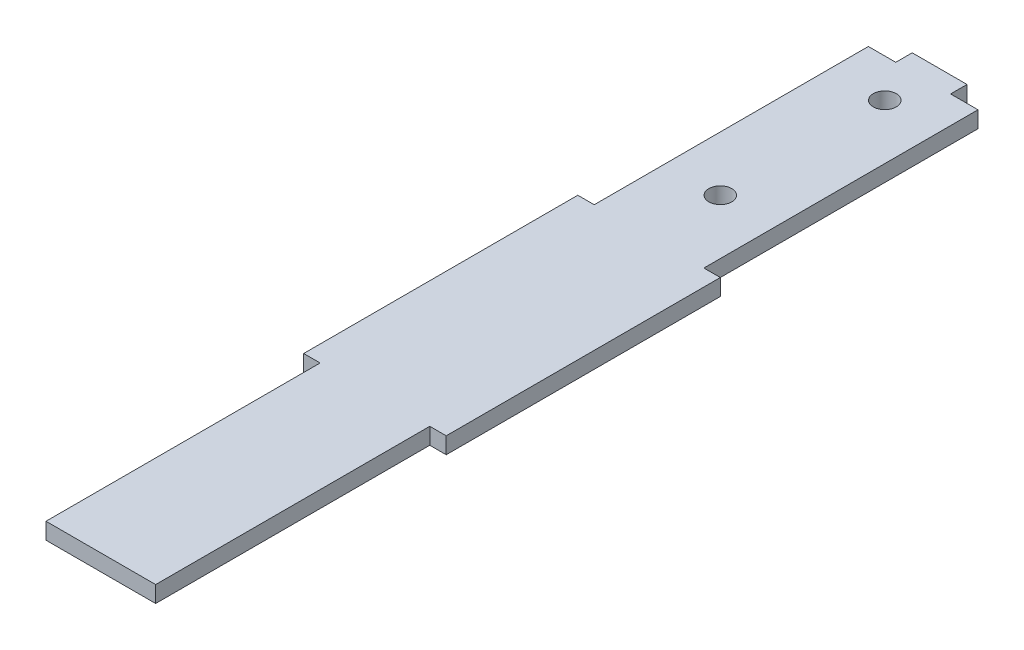
ISO-10303-21;
HEADER;
FILE_DESCRIPTION(('STEP AP214'),'2;1');
FILE_NAME('part.step','',(''),(''),'','','');
FILE_SCHEMA(('AUTOMOTIVE_DESIGN { 1 0 10303 214 1 1 1 1 }'));
ENDSEC;
DATA;
#1=APPLICATION_CONTEXT('core data for automotive mechanical design processes');
#2=APPLICATION_PROTOCOL_DEFINITION('international standard','automotive_design',2000,#1);
#3=PRODUCT_CONTEXT('',#1,'mechanical');
#4=PRODUCT('Part','Part','',(#3));
#5=PRODUCT_RELATED_PRODUCT_CATEGORY('part','',(#4));
#6=PRODUCT_DEFINITION_FORMATION('','',#4);
#7=PRODUCT_DEFINITION_CONTEXT('part definition',#1,'design');
#8=PRODUCT_DEFINITION('design','',#6,#7);
#9=PRODUCT_DEFINITION_SHAPE('','',#8);
#10=(LENGTH_UNIT() NAMED_UNIT(*) SI_UNIT(.MILLI.,.METRE.));
#11=(NAMED_UNIT(*) PLANE_ANGLE_UNIT() SI_UNIT($,.RADIAN.));
#12=(NAMED_UNIT(*) SI_UNIT($,.STERADIAN.) SOLID_ANGLE_UNIT());
#13=UNCERTAINTY_MEASURE_WITH_UNIT(LENGTH_MEASURE(1.E-05),#10,'distance_accuracy_value','');
#14=(GEOMETRIC_REPRESENTATION_CONTEXT(3) GLOBAL_UNCERTAINTY_ASSIGNED_CONTEXT((#13)) GLOBAL_UNIT_ASSIGNED_CONTEXT((#10,
#11,#12)) REPRESENTATION_CONTEXT('',''));
#15=CARTESIAN_POINT('',(0.,0.,0.));
#16=DIRECTION('',(0.,0.,1.));
#17=DIRECTION('',(1.,0.,0.));
#18=AXIS2_PLACEMENT_3D('',#15,#16,#17);
#19=CARTESIAN_POINT('',(0.,3.,0.));
#20=DIRECTION('',(1.,0.,0.));
#21=DIRECTION('',(0.,0.,-1.));
#22=AXIS2_PLACEMENT_3D('',#19,#20,#21);
#23=PLANE('',#22);
#24=DIRECTION('',(0.,0.,1.));
#25=VECTOR('',#24,1.);
#26=CARTESIAN_POINT('',(0.,0.,0.));
#27=LINE('',#26,#25);
#28=CARTESIAN_POINT('',(0.,0.,0.));
#29=VERTEX_POINT('',#28);
#30=CARTESIAN_POINT('',(0.,0.,50.));
#31=VERTEX_POINT('',#30);
#32=EDGE_CURVE('E179',#29,#31,#27,.T.);
#33=ORIENTED_EDGE('',*,*,#32,.T.);
#34=DIRECTION('',(0.,-1.,0.));
#35=VECTOR('',#34,1.);
#36=CARTESIAN_POINT('',(0.,3.,50.));
#37=LINE('',#36,#35);
#38=CARTESIAN_POINT('',(0.,3.,50.));
#39=VERTEX_POINT('',#38);
#40=EDGE_CURVE('E11',#39,#31,#37,.T.);
#41=ORIENTED_EDGE('',*,*,#40,.F.);
#42=DIRECTION('',(0.,0.,1.));
#43=VECTOR('',#42,1.);
#44=CARTESIAN_POINT('',(0.,3.,0.));
#45=LINE('',#44,#43);
#46=CARTESIAN_POINT('',(0.,3.,0.));
#47=VERTEX_POINT('',#46);
#48=EDGE_CURVE('E210',#47,#39,#45,.T.);
#49=ORIENTED_EDGE('',*,*,#48,.F.);
#50=DIRECTION('',(0.,-1.,0.));
#51=VECTOR('',#50,1.);
#52=CARTESIAN_POINT('',(0.,3.,0.));
#53=LINE('',#52,#51);
#54=EDGE_CURVE('E175',#47,#29,#53,.T.);
#55=ORIENTED_EDGE('',*,*,#54,.T.);
#56=EDGE_LOOP('',(#33,#41,#49,#55));
#57=FACE_BOUND('',#56,.T.);
#58=ADVANCED_FACE('F35',(#57),#23,.F.);
#59=CARTESIAN_POINT('',(0.,3.,50.));
#60=DIRECTION('',(0.,0.,1.));
#61=DIRECTION('',(1.,0.,0.));
#62=AXIS2_PLACEMENT_3D('',#59,#60,#61);
#63=PLANE('',#62);
#64=DIRECTION('',(-1.,0.,0.));
#65=VECTOR('',#64,1.);
#66=CARTESIAN_POINT('',(0.,0.,50.));
#67=LINE('',#66,#65);
#68=CARTESIAN_POINT('',(-3.,0.,50.));
#69=VERTEX_POINT('',#68);
#70=EDGE_CURVE('E182',#31,#69,#67,.T.);
#71=ORIENTED_EDGE('',*,*,#70,.T.);
#72=DIRECTION('',(0.,-1.,0.));
#73=VECTOR('',#72,1.);
#74=CARTESIAN_POINT('',(-3.,3.,50.));
#75=LINE('',#74,#73);
#76=CARTESIAN_POINT('',(-3.,3.,50.));
#77=VERTEX_POINT('',#76);
#78=EDGE_CURVE('E43',#77,#69,#75,.T.);
#79=ORIENTED_EDGE('',*,*,#78,.F.);
#80=DIRECTION('',(-1.,0.,0.));
#81=VECTOR('',#80,1.);
#82=CARTESIAN_POINT('',(0.,3.,50.));
#83=LINE('',#82,#81);
#84=EDGE_CURVE('E118',#39,#77,#83,.T.);
#85=ORIENTED_EDGE('',*,*,#84,.F.);
#86=ORIENTED_EDGE('',*,*,#40,.T.);
#87=EDGE_LOOP('',(#71,#79,#85,#86));
#88=FACE_BOUND('',#87,.T.);
#89=ADVANCED_FACE('F310',(#88),#63,.F.);
#90=CARTESIAN_POINT('',(-3.,3.,50.));
#91=DIRECTION('',(1.,0.,0.));
#92=DIRECTION('',(0.,0.,-1.));
#93=AXIS2_PLACEMENT_3D('',#90,#91,#92);
#94=PLANE('',#93);
#95=DIRECTION('',(0.,0.,1.));
#96=VECTOR('',#95,1.);
#97=CARTESIAN_POINT('',(-3.,0.,50.));
#98=LINE('',#97,#96);
#99=CARTESIAN_POINT('',(-2.99999999999999,0.,100.));
#100=VERTEX_POINT('',#99);
#101=EDGE_CURVE('E185',#69,#100,#98,.T.);
#102=ORIENTED_EDGE('',*,*,#101,.T.);
#103=DIRECTION('',(0.,-1.,0.));
#104=VECTOR('',#103,1.);
#105=CARTESIAN_POINT('',(-2.99999999999999,3.,100.));
#106=LINE('',#105,#104);
#107=CARTESIAN_POINT('',(-2.99999999999999,3.,100.));
#108=VERTEX_POINT('',#107);
#109=EDGE_CURVE('E241',#108,#100,#106,.T.);
#110=ORIENTED_EDGE('',*,*,#109,.F.);
#111=DIRECTION('',(0.,0.,1.));
#112=VECTOR('',#111,1.);
#113=CARTESIAN_POINT('',(-3.,3.,50.));
#114=LINE('',#113,#112);
#115=EDGE_CURVE('E249',#77,#108,#114,.T.);
#116=ORIENTED_EDGE('',*,*,#115,.F.);
#117=ORIENTED_EDGE('',*,*,#78,.T.);
#118=EDGE_LOOP('',(#102,#110,#116,#117));
#119=FACE_BOUND('',#118,.T.);
#120=ADVANCED_FACE('F247',(#119),#94,.F.);
#121=CARTESIAN_POINT('',(0.,3.,100.));
#122=DIRECTION('',(0.,0.,-1.));
#123=DIRECTION('',(-1.,0.,0.));
#124=AXIS2_PLACEMENT_3D('',#121,#122,#123);
#125=PLANE('',#124);
#126=DIRECTION('',(1.,0.,0.));
#127=VECTOR('',#126,1.);
#128=CARTESIAN_POINT('',(0.,0.,100.));
#129=LINE('',#128,#127);
#130=CARTESIAN_POINT('',(0.,0.,100.));
#131=VERTEX_POINT('',#130);
#132=EDGE_CURVE('E187',#100,#131,#129,.T.);
#133=ORIENTED_EDGE('',*,*,#132,.T.);
#134=DIRECTION('',(0.,-1.,0.));
#135=VECTOR('',#134,1.);
#136=CARTESIAN_POINT('',(0.,3.,100.));
#137=LINE('',#136,#135);
#138=CARTESIAN_POINT('',(0.,3.,100.));
#139=VERTEX_POINT('',#138);
#140=EDGE_CURVE('E238',#139,#131,#137,.T.);
#141=ORIENTED_EDGE('',*,*,#140,.F.);
#142=DIRECTION('',(1.,0.,0.));
#143=VECTOR('',#142,1.);
#144=CARTESIAN_POINT('',(0.,3.,100.));
#145=LINE('',#144,#143);
#146=EDGE_CURVE('E267',#108,#139,#145,.T.);
#147=ORIENTED_EDGE('',*,*,#146,.F.);
#148=ORIENTED_EDGE('',*,*,#109,.T.);
#149=EDGE_LOOP('',(#133,#141,#147,#148));
#150=FACE_BOUND('',#149,.T.);
#151=ADVANCED_FACE('F258',(#150),#125,.F.);
#152=CARTESIAN_POINT('',(0.,3.,100.));
#153=DIRECTION('',(1.,0.,0.));
#154=DIRECTION('',(0.,0.,-1.));
#155=AXIS2_PLACEMENT_3D('',#152,#153,#154);
#156=PLANE('',#155);
#157=DIRECTION('',(0.,0.,1.));
#158=VECTOR('',#157,1.);
#159=CARTESIAN_POINT('',(0.,0.,100.));
#160=LINE('',#159,#158);
#161=CARTESIAN_POINT('',(0.,0.,150.));
#162=VERTEX_POINT('',#161);
#163=EDGE_CURVE('E189',#131,#162,#160,.T.);
#164=ORIENTED_EDGE('',*,*,#163,.T.);
#165=DIRECTION('',(0.,-1.,0.));
#166=VECTOR('',#165,1.);
#167=CARTESIAN_POINT('',(0.,3.,150.));
#168=LINE('',#167,#166);
#169=CARTESIAN_POINT('',(0.,3.,150.));
#170=VERTEX_POINT('',#169);
#171=EDGE_CURVE('E235',#170,#162,#168,.T.);
#172=ORIENTED_EDGE('',*,*,#171,.F.);
#173=DIRECTION('',(0.,0.,1.));
#174=VECTOR('',#173,1.);
#175=CARTESIAN_POINT('',(0.,3.,100.));
#176=LINE('',#175,#174);
#177=EDGE_CURVE('E264',#139,#170,#176,.T.);
#178=ORIENTED_EDGE('',*,*,#177,.F.);
#179=ORIENTED_EDGE('',*,*,#140,.T.);
#180=EDGE_LOOP('',(#164,#172,#178,#179));
#181=FACE_BOUND('',#180,.T.);
#182=ADVANCED_FACE('F262',(#181),#156,.F.);
#183=CARTESIAN_POINT('',(0.,3.,150.));
#184=DIRECTION('',(0.,0.,-1.));
#185=DIRECTION('',(-1.,0.,0.));
#186=AXIS2_PLACEMENT_3D('',#183,#184,#185);
#187=PLANE('',#186);
#188=DIRECTION('',(1.,0.,0.));
#189=VECTOR('',#188,1.);
#190=CARTESIAN_POINT('',(0.,0.,150.));
#191=LINE('',#190,#189);
#192=CARTESIAN_POINT('',(20.,0.,150.));
#193=VERTEX_POINT('',#192);
#194=EDGE_CURVE('E191',#162,#193,#191,.T.);
#195=ORIENTED_EDGE('',*,*,#194,.T.);
#196=DIRECTION('',(0.,-1.,0.));
#197=VECTOR('',#196,1.);
#198=CARTESIAN_POINT('',(20.,3.,150.));
#199=LINE('',#198,#197);
#200=CARTESIAN_POINT('',(20.,3.,150.));
#201=VERTEX_POINT('',#200);
#202=EDGE_CURVE('E232',#201,#193,#199,.T.);
#203=ORIENTED_EDGE('',*,*,#202,.F.);
#204=DIRECTION('',(1.,0.,0.));
#205=VECTOR('',#204,1.);
#206=CARTESIAN_POINT('',(0.,3.,150.));
#207=LINE('',#206,#205);
#208=EDGE_CURVE('E266',#170,#201,#207,.T.);
#209=ORIENTED_EDGE('',*,*,#208,.F.);
#210=ORIENTED_EDGE('',*,*,#171,.T.);
#211=EDGE_LOOP('',(#195,#203,#209,#210));
#212=FACE_BOUND('',#211,.T.);
#213=ADVANCED_FACE('F323',(#212),#187,.F.);
#214=CARTESIAN_POINT('',(20.,3.,100.));
#215=DIRECTION('',(-1.,0.,0.));
#216=DIRECTION('',(0.,0.,1.));
#217=AXIS2_PLACEMENT_3D('',#214,#215,#216);
#218=PLANE('',#217);
#219=DIRECTION('',(0.,0.,-1.));
#220=VECTOR('',#219,1.);
#221=CARTESIAN_POINT('',(20.,0.,100.));
#222=LINE('',#221,#220);
#223=CARTESIAN_POINT('',(20.,0.,100.));
#224=VERTEX_POINT('',#223);
#225=EDGE_CURVE('E193',#193,#224,#222,.T.);
#226=ORIENTED_EDGE('',*,*,#225,.T.);
#227=DIRECTION('',(0.,-1.,0.));
#228=VECTOR('',#227,1.);
#229=CARTESIAN_POINT('',(20.,3.,100.));
#230=LINE('',#229,#228);
#231=CARTESIAN_POINT('',(20.,3.,100.));
#232=VERTEX_POINT('',#231);
#233=EDGE_CURVE('E229',#232,#224,#230,.T.);
#234=ORIENTED_EDGE('',*,*,#233,.F.);
#235=DIRECTION('',(0.,0.,-1.));
#236=VECTOR('',#235,1.);
#237=CARTESIAN_POINT('',(20.,3.,100.));
#238=LINE('',#237,#236);
#239=EDGE_CURVE('E269',#201,#232,#238,.T.);
#240=ORIENTED_EDGE('',*,*,#239,.F.);
#241=ORIENTED_EDGE('',*,*,#202,.T.);
#242=EDGE_LOOP('',(#226,#234,#240,#241));
#243=FACE_BOUND('',#242,.T.);
#244=ADVANCED_FACE('F326',(#243),#218,.F.);
#245=CARTESIAN_POINT('',(20.,3.,100.));
#246=DIRECTION('',(0.,0.,-1.));
#247=DIRECTION('',(-1.,0.,0.));
#248=AXIS2_PLACEMENT_3D('',#245,#246,#247);
#249=PLANE('',#248);
#250=DIRECTION('',(1.,0.,0.));
#251=VECTOR('',#250,1.);
#252=CARTESIAN_POINT('',(20.,0.,100.));
#253=LINE('',#252,#251);
#254=CARTESIAN_POINT('',(23.,0.,100.));
#255=VERTEX_POINT('',#254);
#256=EDGE_CURVE('E195',#224,#255,#253,.T.);
#257=ORIENTED_EDGE('',*,*,#256,.T.);
#258=DIRECTION('',(0.,-1.,0.));
#259=VECTOR('',#258,1.);
#260=CARTESIAN_POINT('',(23.,3.,100.));
#261=LINE('',#260,#259);
#262=CARTESIAN_POINT('',(23.,3.,100.));
#263=VERTEX_POINT('',#262);
#264=EDGE_CURVE('E226',#263,#255,#261,.T.);
#265=ORIENTED_EDGE('',*,*,#264,.F.);
#266=DIRECTION('',(1.,0.,0.));
#267=VECTOR('',#266,1.);
#268=CARTESIAN_POINT('',(20.,3.,100.));
#269=LINE('',#268,#267);
#270=EDGE_CURVE('E275',#232,#263,#269,.T.);
#271=ORIENTED_EDGE('',*,*,#270,.F.);
#272=ORIENTED_EDGE('',*,*,#233,.T.);
#273=EDGE_LOOP('',(#257,#265,#271,#272));
#274=FACE_BOUND('',#273,.T.);
#275=ADVANCED_FACE('F330',(#274),#249,.F.);
#276=CARTESIAN_POINT('',(23.,3.,50.));
#277=DIRECTION('',(-1.,0.,0.));
#278=DIRECTION('',(0.,0.,1.));
#279=AXIS2_PLACEMENT_3D('',#276,#277,#278);
#280=PLANE('',#279);
#281=DIRECTION('',(0.,0.,-1.));
#282=VECTOR('',#281,1.);
#283=CARTESIAN_POINT('',(23.,0.,50.));
#284=LINE('',#283,#282);
#285=CARTESIAN_POINT('',(23.,0.,50.));
#286=VERTEX_POINT('',#285);
#287=EDGE_CURVE('E197',#255,#286,#284,.T.);
#288=ORIENTED_EDGE('',*,*,#287,.T.);
#289=DIRECTION('',(0.,-1.,0.));
#290=VECTOR('',#289,1.);
#291=CARTESIAN_POINT('',(23.,3.,50.));
#292=LINE('',#291,#290);
#293=CARTESIAN_POINT('',(23.,3.,50.));
#294=VERTEX_POINT('',#293);
#295=EDGE_CURVE('E223',#294,#286,#292,.T.);
#296=ORIENTED_EDGE('',*,*,#295,.F.);
#297=DIRECTION('',(0.,0.,-1.));
#298=VECTOR('',#297,1.);
#299=CARTESIAN_POINT('',(23.,3.,50.));
#300=LINE('',#299,#298);
#301=EDGE_CURVE('E277',#263,#294,#300,.T.);
#302=ORIENTED_EDGE('',*,*,#301,.F.);
#303=ORIENTED_EDGE('',*,*,#264,.T.);
#304=EDGE_LOOP('',(#288,#296,#302,#303));
#305=FACE_BOUND('',#304,.T.);
#306=ADVANCED_FACE('F334',(#305),#280,.F.);
#307=CARTESIAN_POINT('',(20.,3.,50.));
#308=DIRECTION('',(0.,0.,1.));
#309=DIRECTION('',(1.,0.,0.));
#310=AXIS2_PLACEMENT_3D('',#307,#308,#309);
#311=PLANE('',#310);
#312=DIRECTION('',(-1.,0.,0.));
#313=VECTOR('',#312,1.);
#314=CARTESIAN_POINT('',(20.,0.,50.));
#315=LINE('',#314,#313);
#316=CARTESIAN_POINT('',(20.,0.,50.));
#317=VERTEX_POINT('',#316);
#318=EDGE_CURVE('E199',#286,#317,#315,.T.);
#319=ORIENTED_EDGE('',*,*,#318,.T.);
#320=DIRECTION('',(0.,-1.,0.));
#321=VECTOR('',#320,1.);
#322=CARTESIAN_POINT('',(20.,3.,50.));
#323=LINE('',#322,#321);
#324=CARTESIAN_POINT('',(20.,3.,50.));
#325=VERTEX_POINT('',#324);
#326=EDGE_CURVE('E220',#325,#317,#323,.T.);
#327=ORIENTED_EDGE('',*,*,#326,.F.);
#328=DIRECTION('',(-1.,0.,0.));
#329=VECTOR('',#328,1.);
#330=CARTESIAN_POINT('',(20.,3.,50.));
#331=LINE('',#330,#329);
#332=EDGE_CURVE('E279',#294,#325,#331,.T.);
#333=ORIENTED_EDGE('',*,*,#332,.F.);
#334=ORIENTED_EDGE('',*,*,#295,.T.);
#335=EDGE_LOOP('',(#319,#327,#333,#334));
#336=FACE_BOUND('',#335,.T.);
#337=ADVANCED_FACE('F338',(#336),#311,.F.);
#338=CARTESIAN_POINT('',(20.,3.,0.));
#339=DIRECTION('',(-1.,0.,0.));
#340=DIRECTION('',(0.,0.,1.));
#341=AXIS2_PLACEMENT_3D('',#338,#339,#340);
#342=PLANE('',#341);
#343=DIRECTION('',(0.,0.,-1.));
#344=VECTOR('',#343,1.);
#345=CARTESIAN_POINT('',(20.,0.,0.));
#346=LINE('',#345,#344);
#347=CARTESIAN_POINT('',(20.,0.,0.));
#348=VERTEX_POINT('',#347);
#349=EDGE_CURVE('E201',#317,#348,#346,.T.);
#350=ORIENTED_EDGE('',*,*,#349,.T.);
#351=DIRECTION('',(0.,-1.,0.));
#352=VECTOR('',#351,1.);
#353=CARTESIAN_POINT('',(20.,3.,0.));
#354=LINE('',#353,#352);
#355=CARTESIAN_POINT('',(20.,3.,0.));
#356=VERTEX_POINT('',#355);
#357=EDGE_CURVE('E217',#356,#348,#354,.T.);
#358=ORIENTED_EDGE('',*,*,#357,.F.);
#359=DIRECTION('',(0.,0.,-1.));
#360=VECTOR('',#359,1.);
#361=CARTESIAN_POINT('',(20.,3.,0.));
#362=LINE('',#361,#360);
#363=EDGE_CURVE('E281',#325,#356,#362,.T.);
#364=ORIENTED_EDGE('',*,*,#363,.F.);
#365=ORIENTED_EDGE('',*,*,#326,.T.);
#366=EDGE_LOOP('',(#350,#358,#364,#365));
#367=FACE_BOUND('',#366,.T.);
#368=ADVANCED_FACE('F342',(#367),#342,.F.);
#369=CARTESIAN_POINT('',(15.,3.,0.));
#370=DIRECTION('',(0.,0.,1.));
#371=DIRECTION('',(1.,0.,0.));
#372=AXIS2_PLACEMENT_3D('',#369,#370,#371);
#373=PLANE('',#372);
#374=DIRECTION('',(-1.,0.,0.));
#375=VECTOR('',#374,1.);
#376=CARTESIAN_POINT('',(15.,0.,0.));
#377=LINE('',#376,#375);
#378=CARTESIAN_POINT('',(15.,0.,0.));
#379=VERTEX_POINT('',#378);
#380=EDGE_CURVE('E203',#348,#379,#377,.T.);
#381=ORIENTED_EDGE('',*,*,#380,.T.);
#382=DIRECTION('',(0.,-1.,0.));
#383=VECTOR('',#382,1.);
#384=CARTESIAN_POINT('',(15.,3.,0.));
#385=LINE('',#384,#383);
#386=CARTESIAN_POINT('',(15.,3.,0.));
#387=VERTEX_POINT('',#386);
#388=EDGE_CURVE('E214',#387,#379,#385,.T.);
#389=ORIENTED_EDGE('',*,*,#388,.F.);
#390=DIRECTION('',(-1.,0.,0.));
#391=VECTOR('',#390,1.);
#392=CARTESIAN_POINT('',(15.,3.,0.));
#393=LINE('',#392,#391);
#394=EDGE_CURVE('E283',#356,#387,#393,.T.);
#395=ORIENTED_EDGE('',*,*,#394,.F.);
#396=ORIENTED_EDGE('',*,*,#357,.T.);
#397=EDGE_LOOP('',(#381,#389,#395,#396));
#398=FACE_BOUND('',#397,.T.);
#399=ADVANCED_FACE('F289',(#398),#373,.F.);
#400=CARTESIAN_POINT('',(15.,3.,-3.));
#401=DIRECTION('',(-1.,0.,0.));
#402=DIRECTION('',(0.,0.,1.));
#403=AXIS2_PLACEMENT_3D('',#400,#401,#402);
#404=PLANE('',#403);
#405=DIRECTION('',(0.,0.,-1.));
#406=VECTOR('',#405,1.);
#407=CARTESIAN_POINT('',(15.,0.,-3.));
#408=LINE('',#407,#406);
#409=CARTESIAN_POINT('',(15.,0.,-3.));
#410=VERTEX_POINT('',#409);
#411=EDGE_CURVE('E205',#379,#410,#408,.T.);
#412=ORIENTED_EDGE('',*,*,#411,.T.);
#413=DIRECTION('',(0.,-1.,0.));
#414=VECTOR('',#413,1.);
#415=CARTESIAN_POINT('',(15.,3.,-3.));
#416=LINE('',#415,#414);
#417=CARTESIAN_POINT('',(15.,3.,-3.));
#418=VERTEX_POINT('',#417);
#419=EDGE_CURVE('E170',#418,#410,#416,.T.);
#420=ORIENTED_EDGE('',*,*,#419,.F.);
#421=DIRECTION('',(0.,0.,-1.));
#422=VECTOR('',#421,1.);
#423=CARTESIAN_POINT('',(15.,3.,-3.));
#424=LINE('',#423,#422);
#425=EDGE_CURVE('E161',#387,#418,#424,.T.);
#426=ORIENTED_EDGE('',*,*,#425,.F.);
#427=ORIENTED_EDGE('',*,*,#388,.T.);
#428=EDGE_LOOP('',(#412,#420,#426,#427));
#429=FACE_BOUND('',#428,.T.);
#430=ADVANCED_FACE('F293',(#429),#404,.F.);
#431=CARTESIAN_POINT('',(5.,3.,-3.));
#432=DIRECTION('',(0.,0.,1.));
#433=DIRECTION('',(1.,0.,0.));
#434=AXIS2_PLACEMENT_3D('',#431,#432,#433);
#435=PLANE('',#434);
#436=DIRECTION('',(-1.,0.,0.));
#437=VECTOR('',#436,1.);
#438=CARTESIAN_POINT('',(5.,0.,-3.));
#439=LINE('',#438,#437);
#440=CARTESIAN_POINT('',(5.,0.,-3.));
#441=VERTEX_POINT('',#440);
#442=EDGE_CURVE('E169',#410,#441,#439,.T.);
#443=ORIENTED_EDGE('',*,*,#442,.T.);
#444=DIRECTION('',(0.,-1.,0.));
#445=VECTOR('',#444,1.);
#446=CARTESIAN_POINT('',(5.,3.,-3.));
#447=LINE('',#446,#445);
#448=CARTESIAN_POINT('',(5.,3.,-3.));
#449=VERTEX_POINT('',#448);
#450=EDGE_CURVE('E166',#449,#441,#447,.T.);
#451=ORIENTED_EDGE('',*,*,#450,.F.);
#452=DIRECTION('',(-1.,0.,0.));
#453=VECTOR('',#452,1.);
#454=CARTESIAN_POINT('',(5.,3.,-3.));
#455=LINE('',#454,#453);
#456=EDGE_CURVE('E155',#418,#449,#455,.T.);
#457=ORIENTED_EDGE('',*,*,#456,.F.);
#458=ORIENTED_EDGE('',*,*,#419,.T.);
#459=EDGE_LOOP('',(#443,#451,#457,#458));
#460=FACE_BOUND('',#459,.T.);
#461=ADVANCED_FACE('F167',(#460),#435,.F.);
#462=CARTESIAN_POINT('',(5.,3.,-3.));
#463=DIRECTION('',(1.,0.,0.));
#464=DIRECTION('',(0.,0.,-1.));
#465=AXIS2_PLACEMENT_3D('',#462,#463,#464);
#466=PLANE('',#465);
#467=DIRECTION('',(0.,0.,1.));
#468=VECTOR('',#467,1.);
#469=CARTESIAN_POINT('',(5.,0.,-3.));
#470=LINE('',#469,#468);
#471=CARTESIAN_POINT('',(5.,0.,0.));
#472=VERTEX_POINT('',#471);
#473=EDGE_CURVE('E104',#441,#472,#470,.T.);
#474=ORIENTED_EDGE('',*,*,#473,.T.);
#475=DIRECTION('',(0.,-1.,0.));
#476=VECTOR('',#475,1.);
#477=CARTESIAN_POINT('',(5.,3.,0.));
#478=LINE('',#477,#476);
#479=CARTESIAN_POINT('',(5.,3.,0.));
#480=VERTEX_POINT('',#479);
#481=EDGE_CURVE('E171',#480,#472,#478,.T.);
#482=ORIENTED_EDGE('',*,*,#481,.F.);
#483=DIRECTION('',(0.,0.,1.));
#484=VECTOR('',#483,1.);
#485=CARTESIAN_POINT('',(5.,3.,-3.));
#486=LINE('',#485,#484);
#487=EDGE_CURVE('E159',#449,#480,#486,.T.);
#488=ORIENTED_EDGE('',*,*,#487,.F.);
#489=ORIENTED_EDGE('',*,*,#450,.T.);
#490=EDGE_LOOP('',(#474,#482,#488,#489));
#491=FACE_BOUND('',#490,.T.);
#492=ADVANCED_FACE('F173',(#491),#466,.F.);
#493=CARTESIAN_POINT('',(0.,3.,0.));
#494=DIRECTION('',(0.,0.,1.));
#495=DIRECTION('',(1.,0.,0.));
#496=AXIS2_PLACEMENT_3D('',#493,#494,#495);
#497=PLANE('',#496);
#498=DIRECTION('',(-1.,0.,0.));
#499=VECTOR('',#498,1.);
#500=CARTESIAN_POINT('',(0.,0.,0.));
#501=LINE('',#500,#499);
#502=EDGE_CURVE('E110',#472,#29,#501,.T.);
#503=ORIENTED_EDGE('',*,*,#502,.T.);
#504=ORIENTED_EDGE('',*,*,#54,.F.);
#505=DIRECTION('',(-1.,0.,0.));
#506=VECTOR('',#505,1.);
#507=CARTESIAN_POINT('',(0.,3.,0.));
#508=LINE('',#507,#506);
#509=EDGE_CURVE('E51',#480,#47,#508,.T.);
#510=ORIENTED_EDGE('',*,*,#509,.F.);
#511=ORIENTED_EDGE('',*,*,#481,.T.);
#512=EDGE_LOOP('',(#503,#504,#510,#511));
#513=FACE_BOUND('',#512,.T.);
#514=ADVANCED_FACE('F297',(#513),#497,.F.);
#515=CARTESIAN_POINT('',(0.,3.,0.));
#516=DIRECTION('',(0.,-1.,0.));
#517=DIRECTION('',(0.,0.,-1.));
#518=AXIS2_PLACEMENT_3D('',#515,#516,#517);
#519=PLANE('',#518);
#520=CARTESIAN_POINT('',(10.,3.,7.));
#521=DIRECTION('',(0.,1.,0.));
#522=DIRECTION('',(0.,0.,1.));
#523=AXIS2_PLACEMENT_3D('',#520,#521,#522);
#524=CIRCLE('',#523,2.1);
#525=CARTESIAN_POINT('',(10.,3.,9.1));
#526=VERTEX_POINT('',#525);
#527=EDGE_CURVE('E402',#526,#526,#524,.T.);
#528=ORIENTED_EDGE('',*,*,#527,.F.);
#529=EDGE_LOOP('',(#528));
#530=FACE_BOUND('',#529,.T.);
#531=CARTESIAN_POINT('',(10.,3.,37.));
#532=DIRECTION('',(0.,1.,0.));
#533=DIRECTION('',(0.,0.,1.));
#534=AXIS2_PLACEMENT_3D('',#531,#532,#533);
#535=CIRCLE('',#534,2.1);
#536=CARTESIAN_POINT('',(10.,3.,39.1));
#537=VERTEX_POINT('',#536);
#538=EDGE_CURVE('E407',#537,#537,#535,.T.);
#539=ORIENTED_EDGE('',*,*,#538,.F.);
#540=EDGE_LOOP('',(#539));
#541=FACE_BOUND('',#540,.T.);
#542=ORIENTED_EDGE('',*,*,#48,.T.);
#543=ORIENTED_EDGE('',*,*,#84,.T.);
#544=ORIENTED_EDGE('',*,*,#115,.T.);
#545=ORIENTED_EDGE('',*,*,#146,.T.);
#546=ORIENTED_EDGE('',*,*,#177,.T.);
#547=ORIENTED_EDGE('',*,*,#208,.T.);
#548=ORIENTED_EDGE('',*,*,#239,.T.);
#549=ORIENTED_EDGE('',*,*,#270,.T.);
#550=ORIENTED_EDGE('',*,*,#301,.T.);
#551=ORIENTED_EDGE('',*,*,#332,.T.);
#552=ORIENTED_EDGE('',*,*,#363,.T.);
#553=ORIENTED_EDGE('',*,*,#394,.T.);
#554=ORIENTED_EDGE('',*,*,#425,.T.);
#555=ORIENTED_EDGE('',*,*,#456,.T.);
#556=ORIENTED_EDGE('',*,*,#487,.T.);
#557=ORIENTED_EDGE('',*,*,#509,.T.);
#558=EDGE_LOOP('',(#542,#543,#544,#545,#546,#547,#548,#549,#550,#551,#552,#553,#554,#555,#556,#557));
#559=FACE_BOUND('',#558,.T.);
#560=ADVANCED_FACE('F157',(#530,#541,#559),#519,.F.);
#561=CARTESIAN_POINT('',(0.,0.,0.));
#562=DIRECTION('',(0.,-1.,0.));
#563=DIRECTION('',(0.,0.,-1.));
#564=AXIS2_PLACEMENT_3D('',#561,#562,#563);
#565=PLANE('',#564);
#566=CARTESIAN_POINT('',(10.,0.,7.));
#567=DIRECTION('',(0.,1.,0.));
#568=DIRECTION('',(0.,0.,1.));
#569=AXIS2_PLACEMENT_3D('',#566,#567,#568);
#570=CIRCLE('',#569,2.1);
#571=CARTESIAN_POINT('',(10.,0.,9.1));
#572=VERTEX_POINT('',#571);
#573=EDGE_CURVE('E183',#572,#572,#570,.T.);
#574=ORIENTED_EDGE('',*,*,#573,.T.);
#575=EDGE_LOOP('',(#574));
#576=FACE_BOUND('',#575,.T.);
#577=CARTESIAN_POINT('',(10.,0.,37.));
#578=DIRECTION('',(0.,1.,0.));
#579=DIRECTION('',(0.,0.,1.));
#580=AXIS2_PLACEMENT_3D('',#577,#578,#579);
#581=CIRCLE('',#580,2.1);
#582=CARTESIAN_POINT('',(10.,0.,39.1));
#583=VERTEX_POINT('',#582);
#584=EDGE_CURVE('E403',#583,#583,#581,.T.);
#585=ORIENTED_EDGE('',*,*,#584,.T.);
#586=EDGE_LOOP('',(#585));
#587=FACE_BOUND('',#586,.T.);
#588=ORIENTED_EDGE('',*,*,#32,.F.);
#589=ORIENTED_EDGE('',*,*,#502,.F.);
#590=ORIENTED_EDGE('',*,*,#473,.F.);
#591=ORIENTED_EDGE('',*,*,#442,.F.);
#592=ORIENTED_EDGE('',*,*,#411,.F.);
#593=ORIENTED_EDGE('',*,*,#380,.F.);
#594=ORIENTED_EDGE('',*,*,#349,.F.);
#595=ORIENTED_EDGE('',*,*,#318,.F.);
#596=ORIENTED_EDGE('',*,*,#287,.F.);
#597=ORIENTED_EDGE('',*,*,#256,.F.);
#598=ORIENTED_EDGE('',*,*,#225,.F.);
#599=ORIENTED_EDGE('',*,*,#194,.F.);
#600=ORIENTED_EDGE('',*,*,#163,.F.);
#601=ORIENTED_EDGE('',*,*,#132,.F.);
#602=ORIENTED_EDGE('',*,*,#101,.F.);
#603=ORIENTED_EDGE('',*,*,#70,.F.);
#604=EDGE_LOOP('',(#588,#589,#590,#591,#592,#593,#594,#595,#596,#597,#598,#599,#600,#601,#602,#603));
#605=FACE_BOUND('',#604,.T.);
#606=ADVANCED_FACE('F253',(#576,#587,#605),#565,.T.);
#607=CARTESIAN_POINT('',(10.,0.,37.));
#608=DIRECTION('',(0.,1.,0.));
#609=DIRECTION('',(0.,0.,1.));
#610=AXIS2_PLACEMENT_3D('',#607,#608,#609);
#611=CYLINDRICAL_SURFACE('',#610,2.1);
#612=ORIENTED_EDGE('',*,*,#584,.F.);
#613=EDGE_LOOP('',(#612));
#614=FACE_BOUND('',#613,.T.);
#615=ORIENTED_EDGE('',*,*,#538,.T.);
#616=EDGE_LOOP('',(#615));
#617=FACE_BOUND('',#616,.T.);
#618=ADVANCED_FACE('F375',(#614,#617),#611,.F.);
#619=CARTESIAN_POINT('',(10.,0.,7.));
#620=DIRECTION('',(0.,1.,0.));
#621=DIRECTION('',(0.,0.,1.));
#622=AXIS2_PLACEMENT_3D('',#619,#620,#621);
#623=CYLINDRICAL_SURFACE('',#622,2.1);
#624=ORIENTED_EDGE('',*,*,#573,.F.);
#625=EDGE_LOOP('',(#624));
#626=FACE_BOUND('',#625,.T.);
#627=ORIENTED_EDGE('',*,*,#527,.T.);
#628=EDGE_LOOP('',(#627));
#629=FACE_BOUND('',#628,.T.);
#630=ADVANCED_FACE('F383',(#626,#629),#623,.F.);
#631=CLOSED_SHELL('',(#58,#89,#120,#151,#182,#213,#244,#275,#306,#337,#368,#399,#430,#461,#492,
#514,#560,#606,#618,#630));
#632=MANIFOLD_SOLID_BREP('B2',#631);
#633=ADVANCED_BREP_SHAPE_REPRESENTATION('',(#18,#632),#14);
#634=SHAPE_DEFINITION_REPRESENTATION(#9,#633);
ENDSEC;
END-ISO-10303-21;
